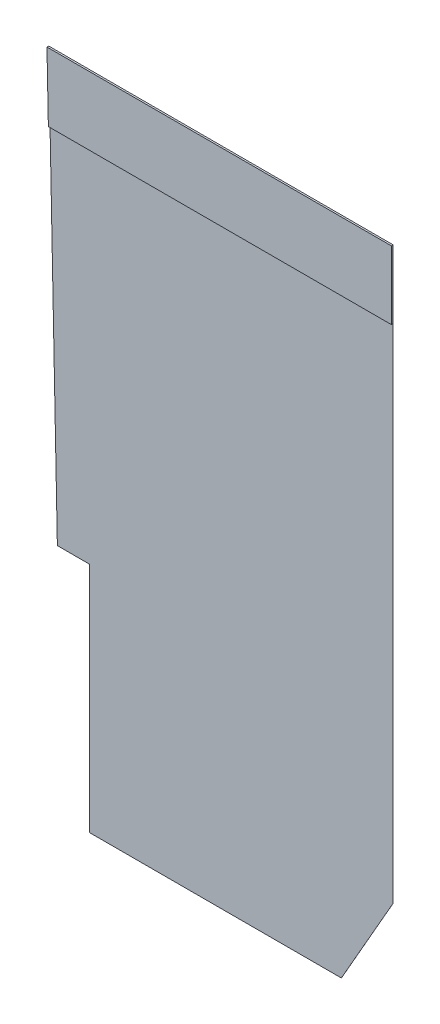
ISO-10303-21;
HEADER;
FILE_DESCRIPTION(('STEP AP214'),'2;1');
FILE_NAME('part.step','',(''),(''),'','','');
FILE_SCHEMA(('AUTOMOTIVE_DESIGN { 1 0 10303 214 1 1 1 1 }'));
ENDSEC;
DATA;
#1=APPLICATION_CONTEXT('core data for automotive mechanical design processes');
#2=APPLICATION_PROTOCOL_DEFINITION('international standard','automotive_design',2000,#1);
#3=PRODUCT_CONTEXT('',#1,'mechanical');
#4=PRODUCT('Part','Part','',(#3));
#5=PRODUCT_RELATED_PRODUCT_CATEGORY('part','',(#4));
#6=PRODUCT_DEFINITION_FORMATION('','',#4);
#7=PRODUCT_DEFINITION_CONTEXT('part definition',#1,'design');
#8=PRODUCT_DEFINITION('design','',#6,#7);
#9=PRODUCT_DEFINITION_SHAPE('','',#8);
#10=(LENGTH_UNIT() NAMED_UNIT(*) SI_UNIT(.MILLI.,.METRE.));
#11=(NAMED_UNIT(*) PLANE_ANGLE_UNIT() SI_UNIT($,.RADIAN.));
#12=(NAMED_UNIT(*) SI_UNIT($,.STERADIAN.) SOLID_ANGLE_UNIT());
#13=UNCERTAINTY_MEASURE_WITH_UNIT(LENGTH_MEASURE(1.E-05),#10,'distance_accuracy_value','');
#14=(GEOMETRIC_REPRESENTATION_CONTEXT(3) GLOBAL_UNCERTAINTY_ASSIGNED_CONTEXT((#13)) GLOBAL_UNIT_ASSIGNED_CONTEXT((#10,
#11,#12)) REPRESENTATION_CONTEXT('',''));
#15=CARTESIAN_POINT('',(0.,0.,0.));
#16=DIRECTION('',(0.,0.,1.));
#17=DIRECTION('',(1.,0.,0.));
#18=AXIS2_PLACEMENT_3D('',#15,#16,#17);
#19=CARTESIAN_POINT('',(0.,0.,1.5875));
#20=DIRECTION('',(0.,0.,-1.));
#21=DIRECTION('',(-1.,0.,0.));
#22=AXIS2_PLACEMENT_3D('',#19,#20,#21);
#23=PLANE('',#22);
#24=DIRECTION('',(1.,0.,0.));
#25=VECTOR('',#24,1.);
#26=CARTESIAN_POINT('',(4635.5,9048.75,1.5875));
#27=LINE('',#26,#25);
#28=CARTESIAN_POINT('',(-601.067572815534,9048.75,1.5875));
#29=VERTEX_POINT('',#28);
#30=CARTESIAN_POINT('',(4635.5,9048.75,1.5875));
#31=VERTEX_POINT('',#30);
#32=EDGE_CURVE('E61',#29,#31,#27,.T.);
#33=ORIENTED_EDGE('',*,*,#32,.F.);
#34=DIRECTION('',(0.02038411327177,-0.999792222377291,0.));
#35=VECTOR('',#34,1.);
#36=CARTESIAN_POINT('',(-488.95,3549.64999999999,1.5875));
#37=LINE('',#36,#35);
#38=CARTESIAN_POINT('',(-488.95,3549.64999999999,1.5875));
#39=VERTEX_POINT('',#38);
#40=EDGE_CURVE('E112',#29,#39,#37,.T.);
#41=ORIENTED_EDGE('',*,*,#40,.T.);
#42=DIRECTION('',(1.,0.,0.));
#43=VECTOR('',#42,1.);
#44=CARTESIAN_POINT('',(0.,3549.65,1.5875));
#45=LINE('',#44,#43);
#46=CARTESIAN_POINT('',(0.,3549.65,1.5875));
#47=VERTEX_POINT('',#46);
#48=EDGE_CURVE('E115',#39,#47,#45,.T.);
#49=ORIENTED_EDGE('',*,*,#48,.T.);
#50=DIRECTION('',(0.,-1.,0.));
#51=VECTOR('',#50,1.);
#52=CARTESIAN_POINT('',(0.,0.,1.5875));
#53=LINE('',#52,#51);
#54=CARTESIAN_POINT('',(0.,0.,1.5875));
#55=VERTEX_POINT('',#54);
#56=EDGE_CURVE('E69',#47,#55,#53,.T.);
#57=ORIENTED_EDGE('',*,*,#56,.T.);
#58=DIRECTION('',(1.,0.,0.));
#59=VECTOR('',#58,1.);
#60=CARTESIAN_POINT('',(3848.1,1.82206673703413E-13,1.5875));
#61=LINE('',#60,#59);
#62=CARTESIAN_POINT('',(3848.1,1.82206673703413E-13,1.5875));
#63=VERTEX_POINT('',#62);
#64=EDGE_CURVE('E166',#55,#63,#61,.T.);
#65=ORIENTED_EDGE('',*,*,#64,.T.);
#66=DIRECTION('',(0.496138938356833,0.868243142124459,0.));
#67=VECTOR('',#66,1.);
#68=CARTESIAN_POINT('',(4635.5,1377.95,1.5875));
#69=LINE('',#68,#67);
#70=CARTESIAN_POINT('',(4635.5,1377.95,1.5875));
#71=VERTEX_POINT('',#70);
#72=EDGE_CURVE('E107',#63,#71,#69,.T.);
#73=ORIENTED_EDGE('',*,*,#72,.T.);
#74=DIRECTION('',(0.,1.,0.));
#75=VECTOR('',#74,1.);
#76=CARTESIAN_POINT('',(4635.5,10090.15,1.5875));
#77=LINE('',#76,#75);
#78=EDGE_CURVE('E121',#71,#31,#77,.T.);
#79=ORIENTED_EDGE('',*,*,#78,.T.);
#80=EDGE_LOOP('',(#33,#41,#49,#57,#65,#73,#79));
#81=FACE_BOUND('',#80,.T.);
#82=ADVANCED_FACE('F45',(#81),#23,.F.);
#83=CARTESIAN_POINT('',(3848.1,1.82206673703413E-13,1.5875));
#84=DIRECTION('',(0.,1.,0.));
#85=DIRECTION('',(-1.,0.,0.));
#86=AXIS2_PLACEMENT_3D('',#83,#84,#85);
#87=PLANE('',#86);
#88=DIRECTION('',(1.,0.,0.));
#89=VECTOR('',#88,1.);
#90=CARTESIAN_POINT('',(3848.1,1.82206673703413E-13,0.));
#91=LINE('',#90,#89);
#92=CARTESIAN_POINT('',(0.,0.,0.));
#93=VERTEX_POINT('',#92);
#94=CARTESIAN_POINT('',(3848.1,1.82206673703413E-13,0.));
#95=VERTEX_POINT('',#94);
#96=EDGE_CURVE('E145',#93,#95,#91,.T.);
#97=ORIENTED_EDGE('',*,*,#96,.T.);
#98=DIRECTION('',(0.,0.,-1.));
#99=VECTOR('',#98,1.);
#100=CARTESIAN_POINT('',(3848.1,1.82206673703413E-13,1.5875));
#101=LINE('',#100,#99);
#102=EDGE_CURVE('E11',#63,#95,#101,.T.);
#103=ORIENTED_EDGE('',*,*,#102,.F.);
#104=ORIENTED_EDGE('',*,*,#64,.F.);
#105=DIRECTION('',(0.,0.,-1.));
#106=VECTOR('',#105,1.);
#107=CARTESIAN_POINT('',(0.,0.,1.5875));
#108=LINE('',#107,#106);
#109=EDGE_CURVE('E141',#55,#93,#108,.T.);
#110=ORIENTED_EDGE('',*,*,#109,.T.);
#111=EDGE_LOOP('',(#97,#103,#104,#110));
#112=FACE_BOUND('',#111,.T.);
#113=ADVANCED_FACE('F47',(#112),#87,.F.);
#114=CARTESIAN_POINT('',(4635.5,1377.95,1.5875));
#115=DIRECTION('',(-0.868243142124459,0.496138938356833,0.));
#116=DIRECTION('',(-0.496138938356833,-0.868243142124459,0.));
#117=AXIS2_PLACEMENT_3D('',#114,#115,#116);
#118=PLANE('',#117);
#119=DIRECTION('',(0.496138938356833,0.868243142124459,0.));
#120=VECTOR('',#119,1.);
#121=CARTESIAN_POINT('',(4635.5,1377.95,0.));
#122=LINE('',#121,#120);
#123=CARTESIAN_POINT('',(4635.5,1377.95,0.));
#124=VERTEX_POINT('',#123);
#125=EDGE_CURVE('E149',#95,#124,#122,.T.);
#126=ORIENTED_EDGE('',*,*,#125,.T.);
#127=DIRECTION('',(0.,0.,-1.));
#128=VECTOR('',#127,1.);
#129=CARTESIAN_POINT('',(4635.5,1377.95,1.5875));
#130=LINE('',#129,#128);
#131=EDGE_CURVE('E54',#71,#124,#130,.T.);
#132=ORIENTED_EDGE('',*,*,#131,.F.);
#133=ORIENTED_EDGE('',*,*,#72,.F.);
#134=ORIENTED_EDGE('',*,*,#102,.T.);
#135=EDGE_LOOP('',(#126,#132,#133,#134));
#136=FACE_BOUND('',#135,.T.);
#137=ADVANCED_FACE('F299',(#136),#118,.F.);
#138=CARTESIAN_POINT('',(4635.5,10090.15,1.5875));
#139=DIRECTION('',(-1.,0.,0.));
#140=DIRECTION('',(0.,-1.,0.));
#141=AXIS2_PLACEMENT_3D('',#138,#139,#140);
#142=PLANE('',#141);
#143=DIRECTION('',(0.,1.,0.));
#144=VECTOR('',#143,1.);
#145=CARTESIAN_POINT('',(4635.5,10090.15,0.));
#146=LINE('',#145,#144);
#147=CARTESIAN_POINT('',(4635.5,10090.15,0.));
#148=VERTEX_POINT('',#147);
#149=EDGE_CURVE('E153',#124,#148,#146,.T.);
#150=ORIENTED_EDGE('',*,*,#149,.T.);
#151=DIRECTION('',(0.,0.,-1.));
#152=VECTOR('',#151,1.);
#153=CARTESIAN_POINT('',(4635.5,10090.15,1.5875));
#154=LINE('',#153,#152);
#155=CARTESIAN_POINT('',(4635.5,10090.15,26.9875));
#156=VERTEX_POINT('',#155);
#157=EDGE_CURVE('E173',#156,#148,#154,.T.);
#158=ORIENTED_EDGE('',*,*,#157,.F.);
#159=DIRECTION('',(0.,1.,0.));
#160=VECTOR('',#159,1.);
#161=CARTESIAN_POINT('',(4635.5,10090.15,26.9875));
#162=LINE('',#161,#160);
#163=CARTESIAN_POINT('',(4635.5,9048.75,26.9875));
#164=VERTEX_POINT('',#163);
#165=EDGE_CURVE('E215',#164,#156,#162,.T.);
#166=ORIENTED_EDGE('',*,*,#165,.F.);
#167=DIRECTION('',(0.,0.,-1.));
#168=VECTOR('',#167,1.);
#169=CARTESIAN_POINT('',(4635.5,9048.75,26.9875));
#170=LINE('',#169,#168);
#171=EDGE_CURVE('E213',#164,#31,#170,.T.);
#172=ORIENTED_EDGE('',*,*,#171,.T.);
#173=ORIENTED_EDGE('',*,*,#78,.F.);
#174=ORIENTED_EDGE('',*,*,#131,.T.);
#175=EDGE_LOOP('',(#150,#158,#166,#172,#173,#174));
#176=FACE_BOUND('',#175,.T.);
#177=ADVANCED_FACE('F183',(#176),#142,.F.);
#178=CARTESIAN_POINT('',(-622.3,10090.15,1.5875));
#179=DIRECTION('',(0.,-1.,0.));
#180=DIRECTION('',(0.,0.,-1.));
#181=AXIS2_PLACEMENT_3D('',#178,#179,#180);
#182=PLANE('',#181);
#183=DIRECTION('',(-1.,0.,0.));
#184=VECTOR('',#183,1.);
#185=CARTESIAN_POINT('',(-622.3,10090.15,0.));
#186=LINE('',#185,#184);
#187=CARTESIAN_POINT('',(-622.3,10090.15,0.));
#188=VERTEX_POINT('',#187);
#189=EDGE_CURVE('E156',#148,#188,#186,.T.);
#190=ORIENTED_EDGE('',*,*,#189,.T.);
#191=DIRECTION('',(0.,0.,-1.));
#192=VECTOR('',#191,1.);
#193=CARTESIAN_POINT('',(-622.3,10090.15,1.5875));
#194=LINE('',#193,#192);
#195=CARTESIAN_POINT('',(-622.3,10090.15,26.9875));
#196=VERTEX_POINT('',#195);
#197=EDGE_CURVE('E132',#196,#188,#194,.T.);
#198=ORIENTED_EDGE('',*,*,#197,.F.);
#199=DIRECTION('',(-1.,0.,0.));
#200=VECTOR('',#199,1.);
#201=CARTESIAN_POINT('',(-622.3,10090.15,26.9875));
#202=LINE('',#201,#200);
#203=EDGE_CURVE('E207',#156,#196,#202,.T.);
#204=ORIENTED_EDGE('',*,*,#203,.F.);
#205=ORIENTED_EDGE('',*,*,#157,.T.);
#206=EDGE_LOOP('',(#190,#198,#204,#205));
#207=FACE_BOUND('',#206,.T.);
#208=ADVANCED_FACE('F192',(#207),#182,.F.);
#209=CARTESIAN_POINT('',(-488.95,3549.64999999999,1.5875));
#210=DIRECTION('',(0.999792222377291,0.02038411327177,0.));
#211=DIRECTION('',(-0.02038411327177,0.999792222377292,0.));
#212=AXIS2_PLACEMENT_3D('',#209,#210,#211);
#213=PLANE('',#212);
#214=DIRECTION('',(0.02038411327177,-0.999792222377291,0.));
#215=VECTOR('',#214,1.);
#216=CARTESIAN_POINT('',(-488.95,3549.64999999999,0.));
#217=LINE('',#216,#215);
#218=CARTESIAN_POINT('',(-488.95,3549.64999999999,0.));
#219=VERTEX_POINT('',#218);
#220=EDGE_CURVE('E128',#188,#219,#217,.T.);
#221=ORIENTED_EDGE('',*,*,#220,.T.);
#222=DIRECTION('',(0.,0.,-1.));
#223=VECTOR('',#222,1.);
#224=CARTESIAN_POINT('',(-488.95,3549.64999999999,1.5875));
#225=LINE('',#224,#223);
#226=EDGE_CURVE('E124',#39,#219,#225,.T.);
#227=ORIENTED_EDGE('',*,*,#226,.F.);
#228=ORIENTED_EDGE('',*,*,#40,.F.);
#229=DIRECTION('',(0.,0.,-1.));
#230=VECTOR('',#229,1.);
#231=CARTESIAN_POINT('',(-601.067572815534,9048.75,26.9875));
#232=LINE('',#231,#230);
#233=CARTESIAN_POINT('',(-601.067572815534,9048.75,26.9875));
#234=VERTEX_POINT('',#233);
#235=EDGE_CURVE('E150',#234,#29,#232,.T.);
#236=ORIENTED_EDGE('',*,*,#235,.F.);
#237=DIRECTION('',(0.0203841132717701,-0.999792222377291,0.));
#238=VECTOR('',#237,1.);
#239=CARTESIAN_POINT('',(-601.067572815534,9048.75,26.9875));
#240=LINE('',#239,#238);
#241=EDGE_CURVE('E198',#196,#234,#240,.T.);
#242=ORIENTED_EDGE('',*,*,#241,.F.);
#243=ORIENTED_EDGE('',*,*,#197,.T.);
#244=EDGE_LOOP('',(#221,#227,#228,#236,#242,#243));
#245=FACE_BOUND('',#244,.T.);
#246=ADVANCED_FACE('F125',(#245),#213,.F.);
#247=CARTESIAN_POINT('',(0.,3549.65,1.5875));
#248=DIRECTION('',(0.,1.,0.));
#249=DIRECTION('',(-1.,0.,0.));
#250=AXIS2_PLACEMENT_3D('',#247,#248,#249);
#251=PLANE('',#250);
#252=DIRECTION('',(1.,0.,0.));
#253=VECTOR('',#252,1.);
#254=CARTESIAN_POINT('',(0.,3549.65,0.));
#255=LINE('',#254,#253);
#256=CARTESIAN_POINT('',(0.,3549.65,0.));
#257=VERTEX_POINT('',#256);
#258=EDGE_CURVE('E161',#219,#257,#255,.T.);
#259=ORIENTED_EDGE('',*,*,#258,.T.);
#260=DIRECTION('',(0.,0.,-1.));
#261=VECTOR('',#260,1.);
#262=CARTESIAN_POINT('',(0.,3549.65,1.5875));
#263=LINE('',#262,#261);
#264=EDGE_CURVE('E133',#47,#257,#263,.T.);
#265=ORIENTED_EDGE('',*,*,#264,.F.);
#266=ORIENTED_EDGE('',*,*,#48,.F.);
#267=ORIENTED_EDGE('',*,*,#226,.T.);
#268=EDGE_LOOP('',(#259,#265,#266,#267));
#269=FACE_BOUND('',#268,.T.);
#270=ADVANCED_FACE('F135',(#269),#251,.F.);
#271=CARTESIAN_POINT('',(0.,0.,1.5875));
#272=DIRECTION('',(1.,0.,0.));
#273=DIRECTION('',(0.,0.,-1.));
#274=AXIS2_PLACEMENT_3D('',#271,#272,#273);
#275=PLANE('',#274);
#276=DIRECTION('',(0.,-1.,0.));
#277=VECTOR('',#276,1.);
#278=CARTESIAN_POINT('',(0.,0.,0.));
#279=LINE('',#278,#277);
#280=EDGE_CURVE('E99',#257,#93,#279,.T.);
#281=ORIENTED_EDGE('',*,*,#280,.T.);
#282=ORIENTED_EDGE('',*,*,#109,.F.);
#283=ORIENTED_EDGE('',*,*,#56,.F.);
#284=ORIENTED_EDGE('',*,*,#264,.T.);
#285=EDGE_LOOP('',(#281,#282,#283,#284));
#286=FACE_BOUND('',#285,.T.);
#287=ADVANCED_FACE('F304',(#286),#275,.F.);
#288=CARTESIAN_POINT('',(0.,0.,0.));
#289=DIRECTION('',(0.,0.,-1.));
#290=DIRECTION('',(-1.,0.,0.));
#291=AXIS2_PLACEMENT_3D('',#288,#289,#290);
#292=PLANE('',#291);
#293=ORIENTED_EDGE('',*,*,#96,.F.);
#294=ORIENTED_EDGE('',*,*,#280,.F.);
#295=ORIENTED_EDGE('',*,*,#258,.F.);
#296=ORIENTED_EDGE('',*,*,#220,.F.);
#297=ORIENTED_EDGE('',*,*,#189,.F.);
#298=ORIENTED_EDGE('',*,*,#149,.F.);
#299=ORIENTED_EDGE('',*,*,#125,.F.);
#300=EDGE_LOOP('',(#293,#294,#295,#296,#297,#298,#299));
#301=FACE_BOUND('',#300,.T.);
#302=ADVANCED_FACE('F189',(#301),#292,.T.);
#303=CARTESIAN_POINT('',(4635.5,9048.75,26.9875));
#304=DIRECTION('',(0.,1.,0.));
#305=DIRECTION('',(0.,0.,1.));
#306=AXIS2_PLACEMENT_3D('',#303,#304,#305);
#307=PLANE('',#306);
#308=ORIENTED_EDGE('',*,*,#32,.T.);
#309=ORIENTED_EDGE('',*,*,#171,.F.);
#310=DIRECTION('',(1.,0.,0.));
#311=VECTOR('',#310,1.);
#312=CARTESIAN_POINT('',(4635.5,9048.75,26.9875));
#313=LINE('',#312,#311);
#314=EDGE_CURVE('E206',#234,#164,#313,.T.);
#315=ORIENTED_EDGE('',*,*,#314,.F.);
#316=ORIENTED_EDGE('',*,*,#235,.T.);
#317=EDGE_LOOP('',(#308,#309,#315,#316));
#318=FACE_BOUND('',#317,.T.);
#319=ADVANCED_FACE('F233',(#318),#307,.F.);
#320=CARTESIAN_POINT('',(0.,0.,26.9875));
#321=DIRECTION('',(0.,0.,-1.));
#322=DIRECTION('',(-1.,0.,0.));
#323=AXIS2_PLACEMENT_3D('',#320,#321,#322);
#324=PLANE('',#323);
#325=ORIENTED_EDGE('',*,*,#165,.T.);
#326=ORIENTED_EDGE('',*,*,#203,.T.);
#327=ORIENTED_EDGE('',*,*,#241,.T.);
#328=ORIENTED_EDGE('',*,*,#314,.T.);
#329=EDGE_LOOP('',(#325,#326,#327,#328));
#330=FACE_BOUND('',#329,.T.);
#331=ADVANCED_FACE('F283',(#330),#324,.F.);
#332=CLOSED_SHELL('',(#82,#113,#137,#177,#208,#246,#270,#287,#302,#319,#331));
#333=MANIFOLD_SOLID_BREP('B2',#332);
#334=ADVANCED_BREP_SHAPE_REPRESENTATION('',(#18,#333),#14);
#335=SHAPE_DEFINITION_REPRESENTATION(#9,#334);
ENDSEC;
END-ISO-10303-21;
